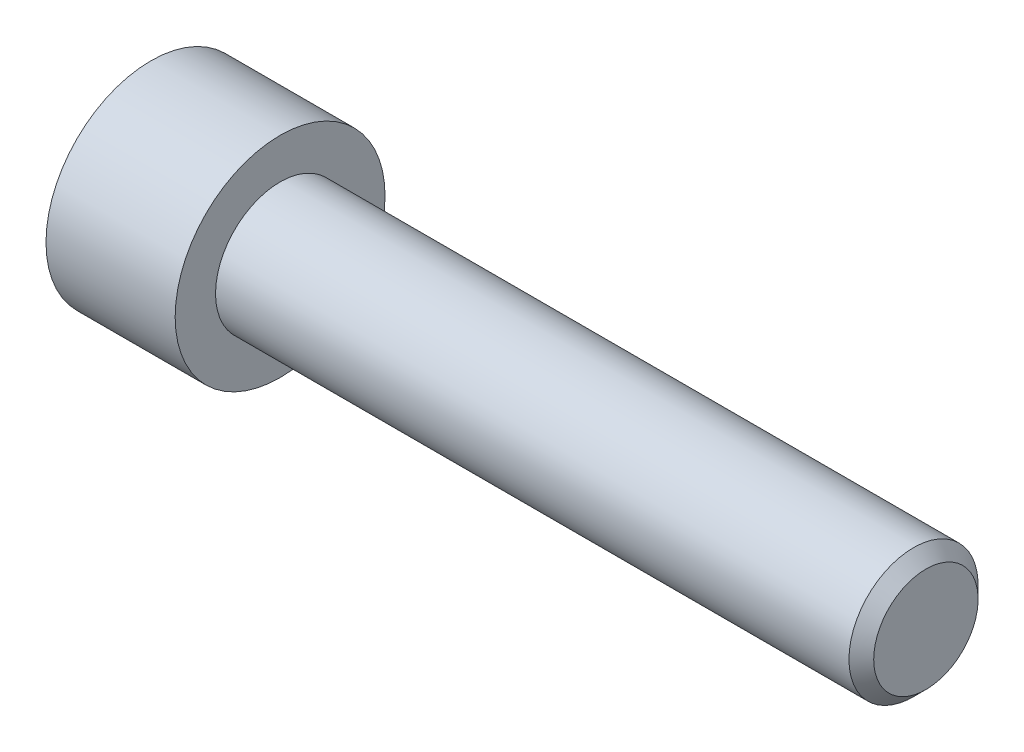
ISO-10303-21;
HEADER;
FILE_DESCRIPTION(('STEP AP214'),'2;1');
FILE_NAME('part.step','',(''),(''),'','','');
FILE_SCHEMA(('AUTOMOTIVE_DESIGN { 1 0 10303 214 1 1 1 1 }'));
ENDSEC;
DATA;
#1=APPLICATION_CONTEXT('core data for automotive mechanical design processes');
#2=APPLICATION_PROTOCOL_DEFINITION('international standard','automotive_design',2000,#1);
#3=PRODUCT_CONTEXT('',#1,'mechanical');
#4=PRODUCT('Part','Part','',(#3));
#5=PRODUCT_RELATED_PRODUCT_CATEGORY('part','',(#4));
#6=PRODUCT_DEFINITION_FORMATION('','',#4);
#7=PRODUCT_DEFINITION_CONTEXT('part definition',#1,'design');
#8=PRODUCT_DEFINITION('design','',#6,#7);
#9=PRODUCT_DEFINITION_SHAPE('','',#8);
#10=(LENGTH_UNIT() NAMED_UNIT(*) SI_UNIT(.MILLI.,.METRE.));
#11=(NAMED_UNIT(*) PLANE_ANGLE_UNIT() SI_UNIT($,.RADIAN.));
#12=(NAMED_UNIT(*) SI_UNIT($,.STERADIAN.) SOLID_ANGLE_UNIT());
#13=UNCERTAINTY_MEASURE_WITH_UNIT(LENGTH_MEASURE(1.E-05),#10,'distance_accuracy_value','');
#14=(GEOMETRIC_REPRESENTATION_CONTEXT(3) GLOBAL_UNCERTAINTY_ASSIGNED_CONTEXT((#13)) GLOBAL_UNIT_ASSIGNED_CONTEXT((#10,
#11,#12)) REPRESENTATION_CONTEXT('',''));
#15=CARTESIAN_POINT('',(0.,0.,0.));
#16=DIRECTION('',(0.,0.,1.));
#17=DIRECTION('',(1.,0.,0.));
#18=AXIS2_PLACEMENT_3D('',#15,#16,#17);
#19=CARTESIAN_POINT('',(-4.0000000000191,0.,0.));
#20=DIRECTION('',(-1.,0.,0.));
#21=DIRECTION('',(0.,0.,1.));
#22=AXIS2_PLACEMENT_3D('',#19,#20,#21);
#23=CONICAL_SURFACE('',#22,2.99000000001115,1.04719755118497);
#24=CARTESIAN_POINT('',(-4.0000000000191,0.,0.));
#25=DIRECTION('',(-1.,0.,0.));
#26=DIRECTION('',(0.,0.,1.));
#27=AXIS2_PLACEMENT_3D('',#24,#25,#26);
#28=CIRCLE('',#27,2.99000000001115);
#29=CARTESIAN_POINT('',(-4.0000000000191,0.,2.99000000001115));
#30=VERTEX_POINT('',#29);
#31=EDGE_CURVE('E18',#30,#30,#28,.T.);
#32=ORIENTED_EDGE('',*,*,#31,.T.);
#33=EDGE_LOOP('',(#32));
#34=FACE_BOUND('',#33,.T.);
#35=CARTESIAN_POINT('',(-2.27372269515058,-5.6843418860808E-11,0.));
#36=VERTEX_POINT('',#35);
#37=VERTEX_LOOP('',#36);
#38=FACE_BOUND('',#37,.T.);
#39=ADVANCED_FACE('F15',(#34,#38),#23,.F.);
#40=CARTESIAN_POINT('',(-4.,0.,0.));
#41=DIRECTION('',(1.,0.,0.));
#42=DIRECTION('',(0.,0.,-1.));
#43=AXIS2_PLACEMENT_3D('',#40,#41,#42);
#44=PLANE('',#43);
#45=ORIENTED_EDGE('',*,*,#31,.F.);
#46=EDGE_LOOP('',(#45));
#47=FACE_BOUND('',#46,.T.);
#48=DIRECTION('',(0.,0.5,0.866025403784439));
#49=VECTOR('',#48,1.);
#50=CARTESIAN_POINT('',(-3.99999999999999,3.46410161513775,0.));
#51=LINE('',#50,#49);
#52=CARTESIAN_POINT('',(-3.99999999999999,3.46410161513775,0.));
#53=VERTEX_POINT('',#52);
#54=CARTESIAN_POINT('',(-4.,1.73205080756888,-3.00000000000001));
#55=VERTEX_POINT('',#54);
#56=EDGE_CURVE('E152',#53,#55,#51,.F.);
#57=ORIENTED_EDGE('',*,*,#56,.T.);
#58=DIRECTION('',(0.,1.,0.));
#59=VECTOR('',#58,1.);
#60=CARTESIAN_POINT('',(-4.,1.73205080756889,-3.));
#61=LINE('',#60,#59);
#62=CARTESIAN_POINT('',(-3.99999999999999,-1.73205080756887,-3.00000000000001));
#63=VERTEX_POINT('',#62);
#64=EDGE_CURVE('E161',#55,#63,#61,.F.);
#65=ORIENTED_EDGE('',*,*,#64,.T.);
#66=DIRECTION('',(0.,0.5,-0.866025403784439));
#67=VECTOR('',#66,1.);
#68=CARTESIAN_POINT('',(-3.99999999999999,-1.73205080756887,-3.00000000000001));
#69=LINE('',#68,#67);
#70=CARTESIAN_POINT('',(-4.,-3.46410161513774,0.));
#71=VERTEX_POINT('',#70);
#72=EDGE_CURVE('E166',#63,#71,#69,.F.);
#73=ORIENTED_EDGE('',*,*,#72,.T.);
#74=DIRECTION('',(0.,-0.5,-0.866025403784439));
#75=VECTOR('',#74,1.);
#76=CARTESIAN_POINT('',(-4.,-3.46410161513774,0.));
#77=LINE('',#76,#75);
#78=CARTESIAN_POINT('',(-4.,-1.73205080756888,3.));
#79=VERTEX_POINT('',#78);
#80=EDGE_CURVE('E171',#71,#79,#77,.F.);
#81=ORIENTED_EDGE('',*,*,#80,.T.);
#82=DIRECTION('',(0.,1.,0.));
#83=VECTOR('',#82,1.);
#84=CARTESIAN_POINT('',(-4.,-1.73205080756888,3.));
#85=LINE('',#84,#83);
#86=CARTESIAN_POINT('',(-3.99999999999999,1.73205080756888,3.));
#87=VERTEX_POINT('',#86);
#88=EDGE_CURVE('E138',#79,#87,#85,.T.);
#89=ORIENTED_EDGE('',*,*,#88,.T.);
#90=DIRECTION('',(0.,-0.5,0.866025403784439));
#91=VECTOR('',#90,1.);
#92=CARTESIAN_POINT('',(-3.99999999999999,1.73205080756888,3.));
#93=LINE('',#92,#91);
#94=EDGE_CURVE('E67',#87,#53,#93,.F.);
#95=ORIENTED_EDGE('',*,*,#94,.T.);
#96=EDGE_LOOP('',(#57,#65,#73,#81,#89,#95));
#97=FACE_BOUND('',#96,.T.);
#98=ADVANCED_FACE('F72',(#47,#97),#44,.F.);
#99=CARTESIAN_POINT('',(-7.99999999999999,1.73205080756889,2.99999999999999));
#100=DIRECTION('',(0.,0.866025403784439,0.5));
#101=DIRECTION('',(0.,-0.5,0.866025403784439));
#102=AXIS2_PLACEMENT_3D('',#99,#100,#101);
#103=PLANE('',#102);
#104=DIRECTION('',(1.,0.,0.));
#105=VECTOR('',#104,1.);
#106=CARTESIAN_POINT('',(-7.99999999999999,1.73205080756889,2.99999999999999));
#107=LINE('',#106,#105);
#108=CARTESIAN_POINT('',(-7.99999999999999,1.73205080756889,2.99999999999999));
#109=VERTEX_POINT('',#108);
#110=EDGE_CURVE('E133',#87,#109,#107,.F.);
#111=ORIENTED_EDGE('',*,*,#110,.T.);
#112=DIRECTION('',(0.,-0.499999999999998,0.866025403784439));
#113=VECTOR('',#112,1.);
#114=CARTESIAN_POINT('',(-7.99999999999999,3.46410161513775,0.));
#115=LINE('',#114,#113);
#116=CARTESIAN_POINT('',(-7.99999999999999,3.46410161513776,0.));
#117=VERTEX_POINT('',#116);
#118=EDGE_CURVE('E136',#117,#109,#115,.T.);
#119=ORIENTED_EDGE('',*,*,#118,.F.);
#120=DIRECTION('',(1.,0.,0.));
#121=VECTOR('',#120,1.);
#122=CARTESIAN_POINT('',(-7.99999999999999,3.46410161513775,0.));
#123=LINE('',#122,#121);
#124=EDGE_CURVE('E155',#117,#53,#123,.T.);
#125=ORIENTED_EDGE('',*,*,#124,.T.);
#126=ORIENTED_EDGE('',*,*,#94,.F.);
#127=EDGE_LOOP('',(#111,#119,#125,#126));
#128=FACE_BOUND('',#127,.T.);
#129=ADVANCED_FACE('F78',(#128),#103,.F.);
#130=CARTESIAN_POINT('',(-7.99999999999999,-1.73205080756888,3.));
#131=DIRECTION('',(0.,0.,1.));
#132=DIRECTION('',(1.,0.,0.));
#133=AXIS2_PLACEMENT_3D('',#130,#131,#132);
#134=PLANE('',#133);
#135=DIRECTION('',(1.,0.,0.));
#136=VECTOR('',#135,1.);
#137=CARTESIAN_POINT('',(-7.99999999999999,-1.73205080756887,3.));
#138=LINE('',#137,#136);
#139=CARTESIAN_POINT('',(-7.99999999999999,-1.73205080756888,3.));
#140=VERTEX_POINT('',#139);
#141=EDGE_CURVE('E143',#79,#140,#138,.F.);
#142=ORIENTED_EDGE('',*,*,#141,.T.);
#143=DIRECTION('',(0.,1.,0.));
#144=VECTOR('',#143,1.);
#145=CARTESIAN_POINT('',(-7.99999999999999,3.25,3.));
#146=LINE('',#145,#144);
#147=EDGE_CURVE('E141',#109,#140,#146,.F.);
#148=ORIENTED_EDGE('',*,*,#147,.F.);
#149=ORIENTED_EDGE('',*,*,#110,.F.);
#150=ORIENTED_EDGE('',*,*,#88,.F.);
#151=EDGE_LOOP('',(#142,#148,#149,#150));
#152=FACE_BOUND('',#151,.T.);
#153=ADVANCED_FACE('F124',(#152),#134,.F.);
#154=CARTESIAN_POINT('',(-8.00000000000001,-3.46410161513775,0.));
#155=DIRECTION('',(0.,-0.866025403784439,0.5));
#156=DIRECTION('',(0.,-0.5,-0.866025403784439));
#157=AXIS2_PLACEMENT_3D('',#154,#155,#156);
#158=PLANE('',#157);
#159=DIRECTION('',(1.,0.,0.));
#160=VECTOR('',#159,1.);
#161=CARTESIAN_POINT('',(-8.00000000000001,-3.46410161513776,0.));
#162=LINE('',#161,#160);
#163=CARTESIAN_POINT('',(-8.00000000000001,-3.46410161513775,0.));
#164=VERTEX_POINT('',#163);
#165=EDGE_CURVE('E169',#71,#164,#162,.F.);
#166=ORIENTED_EDGE('',*,*,#165,.T.);
#167=DIRECTION('',(0.,-0.499999999999998,-0.866025403784439));
#168=VECTOR('',#167,1.);
#169=CARTESIAN_POINT('',(-7.99999999999999,-1.73205080756888,3.));
#170=LINE('',#169,#168);
#171=EDGE_CURVE('E146',#140,#164,#170,.T.);
#172=ORIENTED_EDGE('',*,*,#171,.F.);
#173=ORIENTED_EDGE('',*,*,#141,.F.);
#174=ORIENTED_EDGE('',*,*,#80,.F.);
#175=EDGE_LOOP('',(#166,#172,#173,#174));
#176=FACE_BOUND('',#175,.T.);
#177=ADVANCED_FACE('F120',(#176),#158,.F.);
#178=CARTESIAN_POINT('',(-7.99999999999999,-1.73205080756888,-3.00000000000001));
#179=DIRECTION('',(0.,-0.866025403784439,-0.5));
#180=DIRECTION('',(0.,0.5,-0.866025403784439));
#181=AXIS2_PLACEMENT_3D('',#178,#179,#180);
#182=PLANE('',#181);
#183=DIRECTION('',(-1.,0.,0.));
#184=VECTOR('',#183,1.);
#185=CARTESIAN_POINT('',(-7.99999999999999,-1.73205080756888,-3.00000000000001));
#186=LINE('',#185,#184);
#187=CARTESIAN_POINT('',(-7.99999999999999,-1.73205080756888,-3.00000000000001));
#188=VERTEX_POINT('',#187);
#189=EDGE_CURVE('E164',#63,#188,#186,.T.);
#190=ORIENTED_EDGE('',*,*,#189,.T.);
#191=DIRECTION('',(0.,0.499999999999998,-0.86602540378444));
#192=VECTOR('',#191,1.);
#193=CARTESIAN_POINT('',(-8.00000000000001,-3.46410161513775,0.));
#194=LINE('',#193,#192);
#195=EDGE_CURVE('E189',#164,#188,#194,.T.);
#196=ORIENTED_EDGE('',*,*,#195,.F.);
#197=ORIENTED_EDGE('',*,*,#165,.F.);
#198=ORIENTED_EDGE('',*,*,#72,.F.);
#199=EDGE_LOOP('',(#190,#196,#197,#198));
#200=FACE_BOUND('',#199,.T.);
#201=ADVANCED_FACE('F117',(#200),#182,.F.);
#202=CARTESIAN_POINT('',(-8.00000000000001,1.73205080756888,-2.99999999999999));
#203=DIRECTION('',(0.,0.,-1.));
#204=DIRECTION('',(-1.,0.,0.));
#205=AXIS2_PLACEMENT_3D('',#202,#203,#204);
#206=PLANE('',#205);
#207=DIRECTION('',(1.,0.,0.));
#208=VECTOR('',#207,1.);
#209=CARTESIAN_POINT('',(-8.00000000000001,1.73205080756887,-3.));
#210=LINE('',#209,#208);
#211=CARTESIAN_POINT('',(-8.00000000000001,1.73205080756889,-3.));
#212=VERTEX_POINT('',#211);
#213=EDGE_CURVE('E33',#55,#212,#210,.F.);
#214=ORIENTED_EDGE('',*,*,#213,.T.);
#215=DIRECTION('',(0.,1.,0.));
#216=VECTOR('',#215,1.);
#217=CARTESIAN_POINT('',(-8.00000000000001,3.25,-3.));
#218=LINE('',#217,#216);
#219=EDGE_CURVE('E187',#188,#212,#218,.T.);
#220=ORIENTED_EDGE('',*,*,#219,.F.);
#221=ORIENTED_EDGE('',*,*,#189,.F.);
#222=ORIENTED_EDGE('',*,*,#64,.F.);
#223=EDGE_LOOP('',(#214,#220,#221,#222));
#224=FACE_BOUND('',#223,.T.);
#225=ADVANCED_FACE('F113',(#224),#206,.F.);
#226=CARTESIAN_POINT('',(-7.99999999999999,3.46410161513775,0.));
#227=DIRECTION('',(0.,0.866025403784439,-0.5));
#228=DIRECTION('',(0.,0.5,0.866025403784439));
#229=AXIS2_PLACEMENT_3D('',#226,#227,#228);
#230=PLANE('',#229);
#231=ORIENTED_EDGE('',*,*,#124,.F.);
#232=DIRECTION('',(0.,0.499999999999998,0.866025403784439));
#233=VECTOR('',#232,1.);
#234=CARTESIAN_POINT('',(-8.00000000000001,1.73205080756888,-2.99999999999999));
#235=LINE('',#234,#233);
#236=EDGE_CURVE('E151',#212,#117,#235,.T.);
#237=ORIENTED_EDGE('',*,*,#236,.F.);
#238=ORIENTED_EDGE('',*,*,#213,.F.);
#239=ORIENTED_EDGE('',*,*,#56,.F.);
#240=EDGE_LOOP('',(#231,#237,#238,#239));
#241=FACE_BOUND('',#240,.T.);
#242=ADVANCED_FACE('F109',(#241),#230,.F.);
#243=CARTESIAN_POINT('',(-7.99999999999999,3.25,0.));
#244=DIRECTION('',(-1.,0.,0.));
#245=DIRECTION('',(0.,0.,1.));
#246=AXIS2_PLACEMENT_3D('',#243,#244,#245);
#247=PLANE('',#246);
#248=ORIENTED_EDGE('',*,*,#219,.T.);
#249=ORIENTED_EDGE('',*,*,#236,.T.);
#250=ORIENTED_EDGE('',*,*,#118,.T.);
#251=ORIENTED_EDGE('',*,*,#147,.T.);
#252=ORIENTED_EDGE('',*,*,#171,.T.);
#253=ORIENTED_EDGE('',*,*,#195,.T.);
#254=EDGE_LOOP('',(#248,#249,#250,#251,#252,#253));
#255=FACE_BOUND('',#254,.T.);
#256=CARTESIAN_POINT('',(-8.00000000000001,0.,0.));
#257=DIRECTION('',(-1.,0.,0.));
#258=DIRECTION('',(0.,0.,1.));
#259=AXIS2_PLACEMENT_3D('',#256,#257,#258);
#260=CIRCLE('',#259,6.5);
#261=CARTESIAN_POINT('',(-8.00000000000001,0.,6.5));
#262=VERTEX_POINT('',#261);
#263=EDGE_CURVE('E183',#262,#262,#260,.F.);
#264=ORIENTED_EDGE('',*,*,#263,.F.);
#265=EDGE_LOOP('',(#264));
#266=FACE_BOUND('',#265,.T.);
#267=ADVANCED_FACE('F105',(#255,#266),#247,.T.);
#268=CARTESIAN_POINT('',(-4.,0.,0.));
#269=DIRECTION('',(-1.,0.,0.));
#270=DIRECTION('',(0.,0.,1.));
#271=AXIS2_PLACEMENT_3D('',#268,#269,#270);
#272=CYLINDRICAL_SURFACE('',#271,6.5);
#273=CARTESIAN_POINT('',(0.,0.,0.));
#274=DIRECTION('',(-1.,0.,0.));
#275=DIRECTION('',(0.,0.,1.));
#276=AXIS2_PLACEMENT_3D('',#273,#274,#275);
#277=CIRCLE('',#276,6.5);
#278=CARTESIAN_POINT('',(0.,0.,6.5));
#279=VERTEX_POINT('',#278);
#280=EDGE_CURVE('E181',#279,#279,#277,.F.);
#281=ORIENTED_EDGE('',*,*,#280,.F.);
#282=EDGE_LOOP('',(#281));
#283=FACE_BOUND('',#282,.T.);
#284=ORIENTED_EDGE('',*,*,#263,.T.);
#285=EDGE_LOOP('',(#284));
#286=FACE_BOUND('',#285,.T.);
#287=ADVANCED_FACE('F101',(#283,#286),#272,.T.);
#288=CARTESIAN_POINT('',(40.,1.6165,0.));
#289=DIRECTION('',(1.,0.,0.));
#290=DIRECTION('',(0.,0.,-1.));
#291=AXIS2_PLACEMENT_3D('',#288,#289,#290);
#292=PLANE('',#291);
#293=CARTESIAN_POINT('',(40.0000000000773,0.,0.));
#294=DIRECTION('',(-1.,0.,0.));
#295=DIRECTION('',(0.,0.,1.));
#296=AXIS2_PLACEMENT_3D('',#293,#294,#295);
#297=CIRCLE('',#296,3.23300000002291);
#298=CARTESIAN_POINT('',(40.0000000000773,0.,3.2330000000229));
#299=VERTEX_POINT('',#298);
#300=EDGE_CURVE('E178',#299,#299,#297,.T.);
#301=ORIENTED_EDGE('',*,*,#300,.F.);
#302=EDGE_LOOP('',(#301));
#303=FACE_BOUND('',#302,.T.);
#304=ADVANCED_FACE('F97',(#303),#292,.T.);
#305=CARTESIAN_POINT('',(0.,5.25,0.));
#306=DIRECTION('',(1.,0.,0.));
#307=DIRECTION('',(0.,0.,-1.));
#308=AXIS2_PLACEMENT_3D('',#305,#306,#307);
#309=PLANE('',#308);
#310=CARTESIAN_POINT('',(0.,0.,0.));
#311=DIRECTION('',(-1.,0.,0.));
#312=DIRECTION('',(0.,0.,1.));
#313=AXIS2_PLACEMENT_3D('',#310,#311,#312);
#314=CIRCLE('',#313,4.);
#315=CARTESIAN_POINT('',(0.,0.,4.));
#316=VERTEX_POINT('',#315);
#317=EDGE_CURVE('E24',#316,#316,#314,.F.);
#318=ORIENTED_EDGE('',*,*,#317,.F.);
#319=EDGE_LOOP('',(#318));
#320=FACE_BOUND('',#319,.T.);
#321=ORIENTED_EDGE('',*,*,#280,.T.);
#322=EDGE_LOOP('',(#321));
#323=FACE_BOUND('',#322,.T.);
#324=ADVANCED_FACE('F89',(#320,#323),#309,.T.);
#325=CARTESIAN_POINT('',(39.233000000138,0.,0.));
#326=DIRECTION('',(-1.,0.,0.));
#327=DIRECTION('',(0.,0.,1.));
#328=AXIS2_PLACEMENT_3D('',#325,#326,#327);
#329=CONICAL_SURFACE('',#328,3.99999999996226,0.785398163397448);
#330=ORIENTED_EDGE('',*,*,#300,.T.);
#331=EDGE_LOOP('',(#330));
#332=FACE_BOUND('',#331,.T.);
#333=CARTESIAN_POINT('',(39.233,0.,0.));
#334=DIRECTION('',(-1.,0.,0.));
#335=DIRECTION('',(0.,0.,1.));
#336=AXIS2_PLACEMENT_3D('',#333,#334,#335);
#337=CIRCLE('',#336,4.);
#338=CARTESIAN_POINT('',(39.233,0.,4.));
#339=VERTEX_POINT('',#338);
#340=EDGE_CURVE('E10',#339,#339,#337,.T.);
#341=ORIENTED_EDGE('',*,*,#340,.F.);
#342=EDGE_LOOP('',(#341));
#343=FACE_BOUND('',#342,.T.);
#344=ADVANCED_FACE('F83',(#332,#343),#329,.T.);
#345=CARTESIAN_POINT('',(19.6165,0.,0.));
#346=DIRECTION('',(-1.,0.,0.));
#347=DIRECTION('',(0.,0.,1.));
#348=AXIS2_PLACEMENT_3D('',#345,#346,#347);
#349=CYLINDRICAL_SURFACE('',#348,4.);
#350=ORIENTED_EDGE('',*,*,#317,.T.);
#351=EDGE_LOOP('',(#350));
#352=FACE_BOUND('',#351,.T.);
#353=ORIENTED_EDGE('',*,*,#340,.T.);
#354=EDGE_LOOP('',(#353));
#355=FACE_BOUND('',#354,.T.);
#356=ADVANCED_FACE('F81',(#352,#355),#349,.T.);
#357=CLOSED_SHELL('',(#39,#98,#129,#153,#177,#201,#225,#242,#267,#287,#304,#324,#344,#356));
#358=MANIFOLD_SOLID_BREP('B1',#357);
#359=ADVANCED_BREP_SHAPE_REPRESENTATION('',(#18,#358),#14);
#360=SHAPE_DEFINITION_REPRESENTATION(#9,#359);
ENDSEC;
END-ISO-10303-21;
